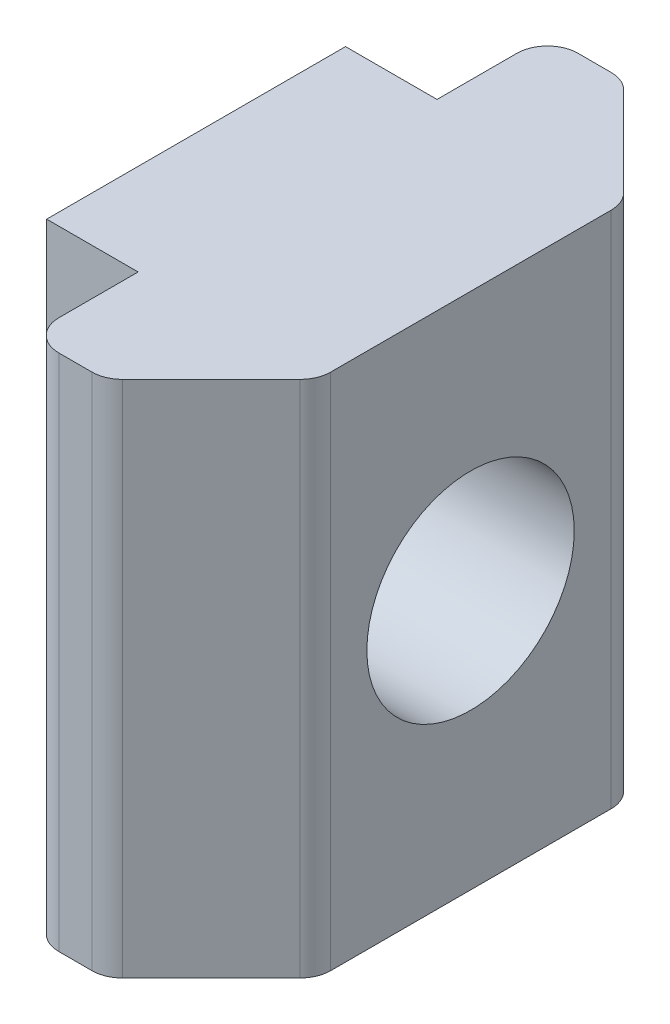
ISO-10303-21;
HEADER;
FILE_DESCRIPTION(('STEP AP214'),'2;1');
FILE_NAME('part.step','',(''),(''),'','','');
FILE_SCHEMA(('AUTOMOTIVE_DESIGN { 1 0 10303 214 1 1 1 1 }'));
ENDSEC;
DATA;
#1=APPLICATION_CONTEXT('core data for automotive mechanical design processes');
#2=APPLICATION_PROTOCOL_DEFINITION('international standard','automotive_design',2000,#1);
#3=PRODUCT_CONTEXT('',#1,'mechanical');
#4=PRODUCT('Part','Part','',(#3));
#5=PRODUCT_RELATED_PRODUCT_CATEGORY('part','',(#4));
#6=PRODUCT_DEFINITION_FORMATION('','',#4);
#7=PRODUCT_DEFINITION_CONTEXT('part definition',#1,'design');
#8=PRODUCT_DEFINITION('design','',#6,#7);
#9=PRODUCT_DEFINITION_SHAPE('','',#8);
#10=(LENGTH_UNIT() NAMED_UNIT(*) SI_UNIT(.MILLI.,.METRE.));
#11=(NAMED_UNIT(*) PLANE_ANGLE_UNIT() SI_UNIT($,.RADIAN.));
#12=(NAMED_UNIT(*) SI_UNIT($,.STERADIAN.) SOLID_ANGLE_UNIT());
#13=UNCERTAINTY_MEASURE_WITH_UNIT(LENGTH_MEASURE(1.E-05),#10,'distance_accuracy_value','');
#14=(GEOMETRIC_REPRESENTATION_CONTEXT(3) GLOBAL_UNCERTAINTY_ASSIGNED_CONTEXT((#13)) GLOBAL_UNIT_ASSIGNED_CONTEXT((#10,
#11,#12)) REPRESENTATION_CONTEXT('',''));
#15=CARTESIAN_POINT('',(0.,0.,0.));
#16=DIRECTION('',(0.,0.,1.));
#17=DIRECTION('',(1.,0.,0.));
#18=AXIS2_PLACEMENT_3D('',#15,#16,#17);
#19=CARTESIAN_POINT('',(8.42138897675098,17.,17.559438485096));
#20=DIRECTION('',(0.,-1.,0.));
#21=DIRECTION('',(0.,0.,-1.));
#22=AXIS2_PLACEMENT_3D('',#19,#20,#21);
#23=CYLINDRICAL_SURFACE('',#22,0.999999999999999);
#24=CARTESIAN_POINT('',(8.42138897675098,0.,17.559438485096));
#25=DIRECTION('',(0.,1.,0.));
#26=DIRECTION('',(0.,0.,1.));
#27=AXIS2_PLACEMENT_3D('',#24,#25,#26);
#28=CIRCLE('',#27,0.999999999999999);
#29=CARTESIAN_POINT('',(7.42138897675098,0.,17.5594385374559));
#30=VERTEX_POINT('',#29);
#31=CARTESIAN_POINT('',(8.42138915128389,0.,18.559438485096));
#32=VERTEX_POINT('',#31);
#33=EDGE_CURVE('E177',#30,#32,#28,.T.);
#34=ORIENTED_EDGE('',*,*,#33,.T.);
#35=DIRECTION('',(0.,-1.,0.));
#36=VECTOR('',#35,1.);
#37=CARTESIAN_POINT('',(8.42138915128389,17.,18.559438485096));
#38=LINE('',#37,#36);
#39=CARTESIAN_POINT('',(8.42138915128389,17.,18.559438485096));
#40=VERTEX_POINT('',#39);
#41=EDGE_CURVE('E11',#40,#32,#38,.T.);
#42=ORIENTED_EDGE('',*,*,#41,.F.);
#43=CARTESIAN_POINT('',(8.42138897675098,17.,17.559438485096));
#44=DIRECTION('',(0.,1.,0.));
#45=DIRECTION('',(0.,0.,1.));
#46=AXIS2_PLACEMENT_3D('',#43,#44,#45);
#47=CIRCLE('',#46,0.999999999999999);
#48=CARTESIAN_POINT('',(7.42138897675098,17.,17.5594385374559));
#49=VERTEX_POINT('',#48);
#50=EDGE_CURVE('E208',#49,#40,#47,.T.);
#51=ORIENTED_EDGE('',*,*,#50,.F.);
#52=DIRECTION('',(0.,-1.,0.));
#53=VECTOR('',#52,1.);
#54=CARTESIAN_POINT('',(7.42138897675098,17.,17.5594385374559));
#55=LINE('',#54,#53);
#56=EDGE_CURVE('E173',#49,#30,#55,.T.);
#57=ORIENTED_EDGE('',*,*,#56,.T.);
#58=EDGE_LOOP('',(#34,#42,#51,#57));
#59=FACE_BOUND('',#58,.T.);
#60=ADVANCED_FACE('F33',(#59),#23,.T.);
#61=CARTESIAN_POINT('',(9.50717615128388,17.,18.559438485096));
#62=DIRECTION('',(0.,0.,-1.));
#63=DIRECTION('',(-1.,0.,0.));
#64=AXIS2_PLACEMENT_3D('',#61,#62,#63);
#65=PLANE('',#64);
#66=DIRECTION('',(1.,0.,0.));
#67=VECTOR('',#66,1.);
#68=CARTESIAN_POINT('',(9.50717615128388,0.,18.559438485096));
#69=LINE('',#68,#67);
#70=CARTESIAN_POINT('',(9.50717615128388,0.,18.559438485096));
#71=VERTEX_POINT('',#70);
#72=EDGE_CURVE('E180',#32,#71,#69,.T.);
#73=ORIENTED_EDGE('',*,*,#72,.T.);
#74=DIRECTION('',(0.,-1.,0.));
#75=VECTOR('',#74,1.);
#76=CARTESIAN_POINT('',(9.50717615128388,17.,18.559438485096));
#77=LINE('',#76,#75);
#78=CARTESIAN_POINT('',(9.50717615128388,17.,18.559438485096));
#79=VERTEX_POINT('',#78);
#80=EDGE_CURVE('E41',#79,#71,#77,.T.);
#81=ORIENTED_EDGE('',*,*,#80,.F.);
#82=DIRECTION('',(1.,0.,0.));
#83=VECTOR('',#82,1.);
#84=CARTESIAN_POINT('',(9.50717615128388,17.,18.559438485096));
#85=LINE('',#84,#83);
#86=EDGE_CURVE('E116',#40,#79,#85,.T.);
#87=ORIENTED_EDGE('',*,*,#86,.F.);
#88=ORIENTED_EDGE('',*,*,#41,.T.);
#89=EDGE_LOOP('',(#73,#81,#87,#88));
#90=FACE_BOUND('',#89,.T.);
#91=ADVANCED_FACE('F306',(#90),#65,.F.);
#92=CARTESIAN_POINT('',(9.50717597675096,17.,17.559438485096));
#93=DIRECTION('',(0.,-1.,0.));
#94=DIRECTION('',(0.,0.,-1.));
#95=AXIS2_PLACEMENT_3D('',#92,#93,#94);
#96=CYLINDRICAL_SURFACE('',#95,0.999999999999999);
#97=CARTESIAN_POINT('',(9.50717597675096,0.,17.559438485096));
#98=DIRECTION('',(0.,1.,0.));
#99=DIRECTION('',(0.,0.,1.));
#100=AXIS2_PLACEMENT_3D('',#97,#98,#99);
#101=CIRCLE('',#100,0.999999999999999);
#102=CARTESIAN_POINT('',(10.2142827579375,0.,18.2665452662826));
#103=VERTEX_POINT('',#102);
#104=EDGE_CURVE('E183',#71,#103,#101,.T.);
#105=ORIENTED_EDGE('',*,*,#104,.T.);
#106=DIRECTION('',(0.,-1.,0.));
#107=VECTOR('',#106,1.);
#108=CARTESIAN_POINT('',(10.2142827579375,17.,18.2665452662826));
#109=LINE('',#108,#107);
#110=CARTESIAN_POINT('',(10.2142827579375,17.,18.2665452662826));
#111=VERTEX_POINT('',#110);
#112=EDGE_CURVE('E239',#111,#103,#109,.T.);
#113=ORIENTED_EDGE('',*,*,#112,.F.);
#114=CARTESIAN_POINT('',(9.50717597675096,17.,17.559438485096));
#115=DIRECTION('',(0.,1.,0.));
#116=DIRECTION('',(0.,0.,1.));
#117=AXIS2_PLACEMENT_3D('',#114,#115,#116);
#118=CIRCLE('',#117,0.999999999999999);
#119=EDGE_CURVE('E247',#79,#111,#118,.T.);
#120=ORIENTED_EDGE('',*,*,#119,.F.);
#121=ORIENTED_EDGE('',*,*,#80,.T.);
#122=EDGE_LOOP('',(#105,#113,#120,#121));
#123=FACE_BOUND('',#122,.T.);
#124=ADVANCED_FACE('F245',(#123),#96,.T.);
#125=CARTESIAN_POINT('',(10.2142827579375,17.,18.2665452662826));
#126=DIRECTION('',(-0.707106728093478,0.,-0.707106834279614));
#127=DIRECTION('',(-0.707106834279614,0.,0.707106728093478));
#128=AXIS2_PLACEMENT_3D('',#125,#126,#127);
#129=PLANE('',#128);
#130=DIRECTION('',(0.707106834279614,0.,-0.707106728093477));
#131=VECTOR('',#130,1.);
#132=CARTESIAN_POINT('',(10.2142827579375,0.,18.2665452662826));
#133=LINE('',#132,#131);
#134=CARTESIAN_POINT('',(13.1284959767511,0.,15.352332485096));
#135=VERTEX_POINT('',#134);
#136=EDGE_CURVE('E185',#103,#135,#133,.T.);
#137=ORIENTED_EDGE('',*,*,#136,.T.);
#138=DIRECTION('',(0.,-1.,0.));
#139=VECTOR('',#138,1.);
#140=CARTESIAN_POINT('',(13.1284959767511,17.,15.352332485096));
#141=LINE('',#140,#139);
#142=CARTESIAN_POINT('',(13.1284959767511,17.,15.352332485096));
#143=VERTEX_POINT('',#142);
#144=EDGE_CURVE('E236',#143,#135,#141,.T.);
#145=ORIENTED_EDGE('',*,*,#144,.F.);
#146=DIRECTION('',(0.707106834279614,0.,-0.707106728093477));
#147=VECTOR('',#146,1.);
#148=CARTESIAN_POINT('',(10.2142827579375,17.,18.2665452662826));
#149=LINE('',#148,#147);
#150=EDGE_CURVE('E265',#111,#143,#149,.T.);
#151=ORIENTED_EDGE('',*,*,#150,.F.);
#152=ORIENTED_EDGE('',*,*,#112,.T.);
#153=EDGE_LOOP('',(#137,#145,#151,#152));
#154=FACE_BOUND('',#153,.T.);
#155=ADVANCED_FACE('F256',(#154),#129,.F.);
#156=CARTESIAN_POINT('',(12.421388976752,17.,14.645225922722));
#157=DIRECTION('',(0.,-1.,0.));
#158=DIRECTION('',(0.,0.,-1.));
#159=AXIS2_PLACEMENT_3D('',#156,#157,#158);
#160=CYLINDRICAL_SURFACE('',#159,1.);
#161=CARTESIAN_POINT('',(12.421388976752,0.,14.645225922722));
#162=DIRECTION('',(0.,1.,0.));
#163=DIRECTION('',(0.,0.,1.));
#164=AXIS2_PLACEMENT_3D('',#161,#162,#163);
#165=CIRCLE('',#164,1.);
#166=CARTESIAN_POINT('',(13.421388976751,0.,14.645224485096));
#167=VERTEX_POINT('',#166);
#168=EDGE_CURVE('E187',#135,#167,#165,.T.);
#169=ORIENTED_EDGE('',*,*,#168,.T.);
#170=DIRECTION('',(0.,-1.,0.));
#171=VECTOR('',#170,1.);
#172=CARTESIAN_POINT('',(13.421388976751,17.,14.645224485096));
#173=LINE('',#172,#171);
#174=CARTESIAN_POINT('',(13.421388976751,17.,14.645224485096));
#175=VERTEX_POINT('',#174);
#176=EDGE_CURVE('E233',#175,#167,#173,.T.);
#177=ORIENTED_EDGE('',*,*,#176,.F.);
#178=CARTESIAN_POINT('',(12.421388976752,17.,14.645225922722));
#179=DIRECTION('',(0.,1.,0.));
#180=DIRECTION('',(0.,0.,1.));
#181=AXIS2_PLACEMENT_3D('',#178,#179,#180);
#182=CIRCLE('',#181,1.);
#183=EDGE_CURVE('E262',#143,#175,#182,.T.);
#184=ORIENTED_EDGE('',*,*,#183,.F.);
#185=ORIENTED_EDGE('',*,*,#144,.T.);
#186=EDGE_LOOP('',(#169,#177,#184,#185));
#187=FACE_BOUND('',#186,.T.);
#188=ADVANCED_FACE('F260',(#187),#160,.T.);
#189=CARTESIAN_POINT('',(13.421388976751,17.,14.645224485096));
#190=DIRECTION('',(-1.,0.,0.));
#191=DIRECTION('',(0.,0.,1.));
#192=AXIS2_PLACEMENT_3D('',#189,#190,#191);
#193=PLANE('',#192);
#194=CARTESIAN_POINT('',(13.421388976751,8.5,10.059438485096));
#195=DIRECTION('',(-1.,0.,0.));
#196=DIRECTION('',(0.,0.,1.));
#197=AXIS2_PLACEMENT_3D('',#194,#195,#196);
#198=CIRCLE('',#197,3.4);
#199=CARTESIAN_POINT('',(13.421388976751,8.5,13.459438485096));
#200=VERTEX_POINT('',#199);
#201=EDGE_CURVE('E181',#200,#200,#198,.T.);
#202=ORIENTED_EDGE('',*,*,#201,.T.);
#203=EDGE_LOOP('',(#202));
#204=FACE_BOUND('',#203,.T.);
#205=DIRECTION('',(0.,0.,-1.));
#206=VECTOR('',#205,1.);
#207=CARTESIAN_POINT('',(13.421388976751,0.,14.645224485096));
#208=LINE('',#207,#206);
#209=CARTESIAN_POINT('',(13.421388976751,0.,5.45164148509603));
#210=VERTEX_POINT('',#209);
#211=EDGE_CURVE('E189',#167,#210,#208,.T.);
#212=ORIENTED_EDGE('',*,*,#211,.T.);
#213=DIRECTION('',(0.,-1.,0.));
#214=VECTOR('',#213,1.);
#215=CARTESIAN_POINT('',(13.421388976751,17.,5.45164148509603));
#216=LINE('',#215,#214);
#217=CARTESIAN_POINT('',(13.421388976751,17.,5.45164148509603));
#218=VERTEX_POINT('',#217);
#219=EDGE_CURVE('E230',#218,#210,#216,.T.);
#220=ORIENTED_EDGE('',*,*,#219,.F.);
#221=DIRECTION('',(0.,0.,-1.));
#222=VECTOR('',#221,1.);
#223=CARTESIAN_POINT('',(13.421388976751,17.,14.645224485096));
#224=LINE('',#223,#222);
#225=EDGE_CURVE('E264',#175,#218,#224,.T.);
#226=ORIENTED_EDGE('',*,*,#225,.F.);
#227=ORIENTED_EDGE('',*,*,#176,.T.);
#228=EDGE_LOOP('',(#212,#220,#226,#227));
#229=FACE_BOUND('',#228,.T.);
#230=ADVANCED_FACE('F319',(#204,#229),#193,.F.);
#231=CARTESIAN_POINT('',(12.4213889767511,17.,5.45164204746913));
#232=DIRECTION('',(0.,-1.,0.));
#233=DIRECTION('',(0.,0.,-1.));
#234=AXIS2_PLACEMENT_3D('',#231,#232,#233);
#235=CYLINDRICAL_SURFACE('',#234,1.);
#236=CARTESIAN_POINT('',(12.4213889767511,0.,5.45164204746913));
#237=DIRECTION('',(0.,1.,0.));
#238=DIRECTION('',(0.,0.,1.));
#239=AXIS2_PLACEMENT_3D('',#236,#237,#238);
#240=CIRCLE('',#239,1.);
#241=CARTESIAN_POINT('',(13.1284959767511,0.,4.74453548509602));
#242=VERTEX_POINT('',#241);
#243=EDGE_CURVE('E191',#210,#242,#240,.T.);
#244=ORIENTED_EDGE('',*,*,#243,.T.);
#245=DIRECTION('',(0.,-1.,0.));
#246=VECTOR('',#245,1.);
#247=CARTESIAN_POINT('',(13.1284959767511,17.,4.74453548509602));
#248=LINE('',#247,#246);
#249=CARTESIAN_POINT('',(13.1284959767511,17.,4.74453548509602));
#250=VERTEX_POINT('',#249);
#251=EDGE_CURVE('E227',#250,#242,#248,.T.);
#252=ORIENTED_EDGE('',*,*,#251,.F.);
#253=CARTESIAN_POINT('',(12.4213889767511,17.,5.45164204746913));
#254=DIRECTION('',(0.,1.,0.));
#255=DIRECTION('',(0.,0.,1.));
#256=AXIS2_PLACEMENT_3D('',#253,#254,#255);
#257=CIRCLE('',#256,1.);
#258=EDGE_CURVE('E267',#218,#250,#257,.T.);
#259=ORIENTED_EDGE('',*,*,#258,.F.);
#260=ORIENTED_EDGE('',*,*,#219,.T.);
#261=EDGE_LOOP('',(#244,#252,#259,#260));
#262=FACE_BOUND('',#261,.T.);
#263=ADVANCED_FACE('F322',(#262),#235,.T.);
#264=CARTESIAN_POINT('',(10.2142827579375,17.,1.83032070390948));
#265=DIRECTION('',(-0.707106970734121,0.,0.707106591638924));
#266=DIRECTION('',(0.707106591638924,0.,0.707106970734121));
#267=AXIS2_PLACEMENT_3D('',#264,#265,#266);
#268=PLANE('',#267);
#269=DIRECTION('',(-0.707106591638924,0.,-0.707106970734121));
#270=VECTOR('',#269,1.);
#271=CARTESIAN_POINT('',(10.2142827579375,0.,1.83032070390948));
#272=LINE('',#271,#270);
#273=CARTESIAN_POINT('',(10.2142827579375,0.,1.83032070390948));
#274=VERTEX_POINT('',#273);
#275=EDGE_CURVE('E193',#242,#274,#272,.T.);
#276=ORIENTED_EDGE('',*,*,#275,.T.);
#277=DIRECTION('',(0.,-1.,0.));
#278=VECTOR('',#277,1.);
#279=CARTESIAN_POINT('',(10.2142827579375,17.,1.83032070390948));
#280=LINE('',#279,#278);
#281=CARTESIAN_POINT('',(10.2142827579375,17.,1.83032070390948));
#282=VERTEX_POINT('',#281);
#283=EDGE_CURVE('E224',#282,#274,#280,.T.);
#284=ORIENTED_EDGE('',*,*,#283,.F.);
#285=DIRECTION('',(-0.707106591638924,0.,-0.707106970734121));
#286=VECTOR('',#285,1.);
#287=CARTESIAN_POINT('',(10.2142827579375,17.,1.83032070390948));
#288=LINE('',#287,#286);
#289=EDGE_CURVE('E273',#250,#282,#288,.T.);
#290=ORIENTED_EDGE('',*,*,#289,.F.);
#291=ORIENTED_EDGE('',*,*,#251,.T.);
#292=EDGE_LOOP('',(#276,#284,#290,#291));
#293=FACE_BOUND('',#292,.T.);
#294=ADVANCED_FACE('F326',(#293),#268,.F.);
#295=CARTESIAN_POINT('',(9.50717597675096,17.,2.53742748509603));
#296=DIRECTION('',(0.,-1.,0.));
#297=DIRECTION('',(0.,0.,-1.));
#298=AXIS2_PLACEMENT_3D('',#295,#296,#297);
#299=CYLINDRICAL_SURFACE('',#298,1.);
#300=CARTESIAN_POINT('',(9.50717597675096,0.,2.53742748509603));
#301=DIRECTION('',(0.,1.,0.));
#302=DIRECTION('',(0.,0.,1.));
#303=AXIS2_PLACEMENT_3D('',#300,#301,#302);
#304=CIRCLE('',#303,1.);
#305=CARTESIAN_POINT('',(9.50717597675096,0.,1.53742748509603));
#306=VERTEX_POINT('',#305);
#307=EDGE_CURVE('E195',#274,#306,#304,.T.);
#308=ORIENTED_EDGE('',*,*,#307,.T.);
#309=DIRECTION('',(0.,-1.,0.));
#310=VECTOR('',#309,1.);
#311=CARTESIAN_POINT('',(9.50717597675096,17.,1.53742748509603));
#312=LINE('',#311,#310);
#313=CARTESIAN_POINT('',(9.50717597675096,17.,1.53742748509603));
#314=VERTEX_POINT('',#313);
#315=EDGE_CURVE('E221',#314,#306,#312,.T.);
#316=ORIENTED_EDGE('',*,*,#315,.F.);
#317=CARTESIAN_POINT('',(9.50717597675096,17.,2.53742748509603));
#318=DIRECTION('',(0.,1.,0.));
#319=DIRECTION('',(0.,0.,1.));
#320=AXIS2_PLACEMENT_3D('',#317,#318,#319);
#321=CIRCLE('',#320,1.);
#322=EDGE_CURVE('E275',#282,#314,#321,.T.);
#323=ORIENTED_EDGE('',*,*,#322,.F.);
#324=ORIENTED_EDGE('',*,*,#283,.T.);
#325=EDGE_LOOP('',(#308,#316,#323,#324));
#326=FACE_BOUND('',#325,.T.);
#327=ADVANCED_FACE('F330',(#326),#299,.T.);
#328=CARTESIAN_POINT('',(9.50717597675096,17.,1.53742748509603));
#329=DIRECTION('',(0.,0.,1.));
#330=DIRECTION('',(1.,0.,0.));
#331=AXIS2_PLACEMENT_3D('',#328,#329,#330);
#332=PLANE('',#331);
#333=DIRECTION('',(-1.,0.,0.));
#334=VECTOR('',#333,1.);
#335=CARTESIAN_POINT('',(9.50717597675096,0.,1.53742748509603));
#336=LINE('',#335,#334);
#337=CARTESIAN_POINT('',(8.42138897675098,0.,1.53742748509603));
#338=VERTEX_POINT('',#337);
#339=EDGE_CURVE('E197',#306,#338,#336,.T.);
#340=ORIENTED_EDGE('',*,*,#339,.T.);
#341=DIRECTION('',(0.,-1.,0.));
#342=VECTOR('',#341,1.);
#343=CARTESIAN_POINT('',(8.42138897675098,17.,1.53742748509603));
#344=LINE('',#343,#342);
#345=CARTESIAN_POINT('',(8.42138897675098,17.,1.53742748509603));
#346=VERTEX_POINT('',#345);
#347=EDGE_CURVE('E218',#346,#338,#344,.T.);
#348=ORIENTED_EDGE('',*,*,#347,.F.);
#349=DIRECTION('',(-1.,0.,0.));
#350=VECTOR('',#349,1.);
#351=CARTESIAN_POINT('',(9.50717597675096,17.,1.53742748509603));
#352=LINE('',#351,#350);
#353=EDGE_CURVE('E277',#314,#346,#352,.T.);
#354=ORIENTED_EDGE('',*,*,#353,.F.);
#355=ORIENTED_EDGE('',*,*,#315,.T.);
#356=EDGE_LOOP('',(#340,#348,#354,#355));
#357=FACE_BOUND('',#356,.T.);
#358=ADVANCED_FACE('F334',(#357),#332,.F.);
#359=CARTESIAN_POINT('',(8.42138897675098,17.,2.53742748509603));
#360=DIRECTION('',(0.,-1.,0.));
#361=DIRECTION('',(0.,0.,-1.));
#362=AXIS2_PLACEMENT_3D('',#359,#360,#361);
#363=CYLINDRICAL_SURFACE('',#362,1.);
#364=CARTESIAN_POINT('',(8.42138897675098,0.,2.53742748509603));
#365=DIRECTION('',(0.,1.,0.));
#366=DIRECTION('',(0.,0.,1.));
#367=AXIS2_PLACEMENT_3D('',#364,#365,#366);
#368=CIRCLE('',#367,1.);
#369=CARTESIAN_POINT('',(7.42138897675098,0.,2.53742753745591));
#370=VERTEX_POINT('',#369);
#371=EDGE_CURVE('E199',#338,#370,#368,.T.);
#372=ORIENTED_EDGE('',*,*,#371,.T.);
#373=DIRECTION('',(0.,-1.,0.));
#374=VECTOR('',#373,1.);
#375=CARTESIAN_POINT('',(7.42138897675098,17.,2.53742753745591));
#376=LINE('',#375,#374);
#377=CARTESIAN_POINT('',(7.42138897675098,17.,2.53742753745591));
#378=VERTEX_POINT('',#377);
#379=EDGE_CURVE('E215',#378,#370,#376,.T.);
#380=ORIENTED_EDGE('',*,*,#379,.F.);
#381=CARTESIAN_POINT('',(8.42138897675098,17.,2.53742748509603));
#382=DIRECTION('',(0.,1.,0.));
#383=DIRECTION('',(0.,0.,1.));
#384=AXIS2_PLACEMENT_3D('',#381,#382,#383);
#385=CIRCLE('',#384,1.);
#386=EDGE_CURVE('E279',#346,#378,#385,.T.);
#387=ORIENTED_EDGE('',*,*,#386,.F.);
#388=ORIENTED_EDGE('',*,*,#347,.T.);
#389=EDGE_LOOP('',(#372,#380,#387,#388));
#390=FACE_BOUND('',#389,.T.);
#391=ADVANCED_FACE('F338',(#390),#363,.T.);
#392=CARTESIAN_POINT('',(7.42138897675098,17.,5.15943848509603));
#393=DIRECTION('',(1.,0.,0.));
#394=DIRECTION('',(0.,0.,-1.));
#395=AXIS2_PLACEMENT_3D('',#392,#393,#394);
#396=PLANE('',#395);
#397=DIRECTION('',(0.,0.,1.));
#398=VECTOR('',#397,1.);
#399=CARTESIAN_POINT('',(7.42138897675098,0.,5.15943848509603));
#400=LINE('',#399,#398);
#401=CARTESIAN_POINT('',(7.42138897675098,0.,5.15943848509603));
#402=VERTEX_POINT('',#401);
#403=EDGE_CURVE('E201',#370,#402,#400,.T.);
#404=ORIENTED_EDGE('',*,*,#403,.T.);
#405=DIRECTION('',(0.,-1.,0.));
#406=VECTOR('',#405,1.);
#407=CARTESIAN_POINT('',(7.42138897675098,17.,5.15943848509603));
#408=LINE('',#407,#406);
#409=CARTESIAN_POINT('',(7.42138897675098,17.,5.15943848509603));
#410=VERTEX_POINT('',#409);
#411=EDGE_CURVE('E212',#410,#402,#408,.T.);
#412=ORIENTED_EDGE('',*,*,#411,.F.);
#413=DIRECTION('',(0.,0.,1.));
#414=VECTOR('',#413,1.);
#415=CARTESIAN_POINT('',(7.42138897675098,17.,5.15943848509603));
#416=LINE('',#415,#414);
#417=EDGE_CURVE('E281',#378,#410,#416,.T.);
#418=ORIENTED_EDGE('',*,*,#417,.F.);
#419=ORIENTED_EDGE('',*,*,#379,.T.);
#420=EDGE_LOOP('',(#404,#412,#418,#419));
#421=FACE_BOUND('',#420,.T.);
#422=ADVANCED_FACE('F287',(#421),#396,.F.);
#423=CARTESIAN_POINT('',(7.42138897675098,17.,5.15943848509603));
#424=DIRECTION('',(0.,0.,1.));
#425=DIRECTION('',(1.,0.,0.));
#426=AXIS2_PLACEMENT_3D('',#423,#424,#425);
#427=PLANE('',#426);
#428=DIRECTION('',(-1.,0.,0.));
#429=VECTOR('',#428,1.);
#430=CARTESIAN_POINT('',(7.42138897675098,0.,5.15943848509603));
#431=LINE('',#430,#429);
#432=CARTESIAN_POINT('',(4.421388976751,0.,5.15943848509603));
#433=VERTEX_POINT('',#432);
#434=EDGE_CURVE('E203',#402,#433,#431,.T.);
#435=ORIENTED_EDGE('',*,*,#434,.T.);
#436=DIRECTION('',(0.,-1.,0.));
#437=VECTOR('',#436,1.);
#438=CARTESIAN_POINT('',(4.421388976751,17.,5.15943848509603));
#439=LINE('',#438,#437);
#440=CARTESIAN_POINT('',(4.421388976751,17.,5.15943848509603));
#441=VERTEX_POINT('',#440);
#442=EDGE_CURVE('E168',#441,#433,#439,.T.);
#443=ORIENTED_EDGE('',*,*,#442,.F.);
#444=DIRECTION('',(-1.,0.,0.));
#445=VECTOR('',#444,1.);
#446=CARTESIAN_POINT('',(7.42138897675098,17.,5.15943848509603));
#447=LINE('',#446,#445);
#448=EDGE_CURVE('E159',#410,#441,#447,.T.);
#449=ORIENTED_EDGE('',*,*,#448,.F.);
#450=ORIENTED_EDGE('',*,*,#411,.T.);
#451=EDGE_LOOP('',(#435,#443,#449,#450));
#452=FACE_BOUND('',#451,.T.);
#453=ADVANCED_FACE('F291',(#452),#427,.F.);
#454=CARTESIAN_POINT('',(4.421388976751,17.,14.959438485096));
#455=DIRECTION('',(1.,0.,0.));
#456=DIRECTION('',(0.,0.,-1.));
#457=AXIS2_PLACEMENT_3D('',#454,#455,#456);
#458=PLANE('',#457);
#459=CARTESIAN_POINT('',(4.421388976751,8.5,10.059438485096));
#460=DIRECTION('',(-1.,0.,0.));
#461=DIRECTION('',(0.,0.,1.));
#462=AXIS2_PLACEMENT_3D('',#459,#460,#461);
#463=CIRCLE('',#462,3.4);
#464=CARTESIAN_POINT('',(4.421388976751,8.5,13.459438485096));
#465=VERTEX_POINT('',#464);
#466=EDGE_CURVE('E353',#465,#465,#463,.T.);
#467=ORIENTED_EDGE('',*,*,#466,.F.);
#468=EDGE_LOOP('',(#467));
#469=FACE_BOUND('',#468,.T.);
#470=DIRECTION('',(0.,0.,1.));
#471=VECTOR('',#470,1.);
#472=CARTESIAN_POINT('',(4.421388976751,0.,14.959438485096));
#473=LINE('',#472,#471);
#474=CARTESIAN_POINT('',(4.421388976751,0.,14.959438485096));
#475=VERTEX_POINT('',#474);
#476=EDGE_CURVE('E167',#433,#475,#473,.T.);
#477=ORIENTED_EDGE('',*,*,#476,.T.);
#478=DIRECTION('',(0.,-1.,0.));
#479=VECTOR('',#478,1.);
#480=CARTESIAN_POINT('',(4.421388976751,17.,14.959438485096));
#481=LINE('',#480,#479);
#482=CARTESIAN_POINT('',(4.421388976751,17.,14.959438485096));
#483=VERTEX_POINT('',#482);
#484=EDGE_CURVE('E164',#483,#475,#481,.T.);
#485=ORIENTED_EDGE('',*,*,#484,.F.);
#486=DIRECTION('',(0.,0.,1.));
#487=VECTOR('',#486,1.);
#488=CARTESIAN_POINT('',(4.421388976751,17.,14.959438485096));
#489=LINE('',#488,#487);
#490=EDGE_CURVE('E153',#441,#483,#489,.T.);
#491=ORIENTED_EDGE('',*,*,#490,.F.);
#492=ORIENTED_EDGE('',*,*,#442,.T.);
#493=EDGE_LOOP('',(#477,#485,#491,#492));
#494=FACE_BOUND('',#493,.T.);
#495=ADVANCED_FACE('F165',(#469,#494),#458,.F.);
#496=CARTESIAN_POINT('',(7.42138897675098,17.,14.959438485096));
#497=DIRECTION('',(0.,0.,-1.));
#498=DIRECTION('',(-1.,0.,0.));
#499=AXIS2_PLACEMENT_3D('',#496,#497,#498);
#500=PLANE('',#499);
#501=DIRECTION('',(1.,0.,0.));
#502=VECTOR('',#501,1.);
#503=CARTESIAN_POINT('',(7.42138897675098,0.,14.959438485096));
#504=LINE('',#503,#502);
#505=CARTESIAN_POINT('',(7.42138897675098,0.,14.959438485096));
#506=VERTEX_POINT('',#505);
#507=EDGE_CURVE('E102',#475,#506,#504,.T.);
#508=ORIENTED_EDGE('',*,*,#507,.T.);
#509=DIRECTION('',(0.,-1.,0.));
#510=VECTOR('',#509,1.);
#511=CARTESIAN_POINT('',(7.42138897675098,17.,14.959438485096));
#512=LINE('',#511,#510);
#513=CARTESIAN_POINT('',(7.42138897675098,17.,14.959438485096));
#514=VERTEX_POINT('',#513);
#515=EDGE_CURVE('E169',#514,#506,#512,.T.);
#516=ORIENTED_EDGE('',*,*,#515,.F.);
#517=DIRECTION('',(1.,0.,0.));
#518=VECTOR('',#517,1.);
#519=CARTESIAN_POINT('',(7.42138897675098,17.,14.959438485096));
#520=LINE('',#519,#518);
#521=EDGE_CURVE('E157',#483,#514,#520,.T.);
#522=ORIENTED_EDGE('',*,*,#521,.F.);
#523=ORIENTED_EDGE('',*,*,#484,.T.);
#524=EDGE_LOOP('',(#508,#516,#522,#523));
#525=FACE_BOUND('',#524,.T.);
#526=ADVANCED_FACE('F171',(#525),#500,.F.);
#527=CARTESIAN_POINT('',(7.42138897675098,17.,17.5594385374559));
#528=DIRECTION('',(1.,0.,0.));
#529=DIRECTION('',(0.,0.,-1.));
#530=AXIS2_PLACEMENT_3D('',#527,#528,#529);
#531=PLANE('',#530);
#532=DIRECTION('',(0.,0.,1.));
#533=VECTOR('',#532,1.);
#534=CARTESIAN_POINT('',(7.42138897675098,0.,17.5594385374559));
#535=LINE('',#534,#533);
#536=EDGE_CURVE('E108',#506,#30,#535,.T.);
#537=ORIENTED_EDGE('',*,*,#536,.T.);
#538=ORIENTED_EDGE('',*,*,#56,.F.);
#539=DIRECTION('',(0.,0.,1.));
#540=VECTOR('',#539,1.);
#541=CARTESIAN_POINT('',(7.42138897675098,17.,17.5594385374559));
#542=LINE('',#541,#540);
#543=EDGE_CURVE('E49',#514,#49,#542,.T.);
#544=ORIENTED_EDGE('',*,*,#543,.F.);
#545=ORIENTED_EDGE('',*,*,#515,.T.);
#546=EDGE_LOOP('',(#537,#538,#544,#545));
#547=FACE_BOUND('',#546,.T.);
#548=ADVANCED_FACE('F295',(#547),#531,.F.);
#549=CARTESIAN_POINT('',(8.42138897675098,17.,17.559438485096));
#550=DIRECTION('',(0.,1.,0.));
#551=DIRECTION('',(0.,0.,1.));
#552=AXIS2_PLACEMENT_3D('',#549,#550,#551);
#553=PLANE('',#552);
#554=ORIENTED_EDGE('',*,*,#50,.T.);
#555=ORIENTED_EDGE('',*,*,#86,.T.);
#556=ORIENTED_EDGE('',*,*,#119,.T.);
#557=ORIENTED_EDGE('',*,*,#150,.T.);
#558=ORIENTED_EDGE('',*,*,#183,.T.);
#559=ORIENTED_EDGE('',*,*,#225,.T.);
#560=ORIENTED_EDGE('',*,*,#258,.T.);
#561=ORIENTED_EDGE('',*,*,#289,.T.);
#562=ORIENTED_EDGE('',*,*,#322,.T.);
#563=ORIENTED_EDGE('',*,*,#353,.T.);
#564=ORIENTED_EDGE('',*,*,#386,.T.);
#565=ORIENTED_EDGE('',*,*,#417,.T.);
#566=ORIENTED_EDGE('',*,*,#448,.T.);
#567=ORIENTED_EDGE('',*,*,#490,.T.);
#568=ORIENTED_EDGE('',*,*,#521,.T.);
#569=ORIENTED_EDGE('',*,*,#543,.T.);
#570=EDGE_LOOP('',(#554,#555,#556,#557,#558,#559,#560,#561,#562,#563,#564,#565,#566,#567,#568,#569));
#571=FACE_BOUND('',#570,.T.);
#572=ADVANCED_FACE('F155',(#571),#553,.T.);
#573=CARTESIAN_POINT('',(8.42138897675098,0.,17.559438485096));
#574=DIRECTION('',(0.,1.,0.));
#575=DIRECTION('',(0.,0.,1.));
#576=AXIS2_PLACEMENT_3D('',#573,#574,#575);
#577=PLANE('',#576);
#578=ORIENTED_EDGE('',*,*,#33,.F.);
#579=ORIENTED_EDGE('',*,*,#536,.F.);
#580=ORIENTED_EDGE('',*,*,#507,.F.);
#581=ORIENTED_EDGE('',*,*,#476,.F.);
#582=ORIENTED_EDGE('',*,*,#434,.F.);
#583=ORIENTED_EDGE('',*,*,#403,.F.);
#584=ORIENTED_EDGE('',*,*,#371,.F.);
#585=ORIENTED_EDGE('',*,*,#339,.F.);
#586=ORIENTED_EDGE('',*,*,#307,.F.);
#587=ORIENTED_EDGE('',*,*,#275,.F.);
#588=ORIENTED_EDGE('',*,*,#243,.F.);
#589=ORIENTED_EDGE('',*,*,#211,.F.);
#590=ORIENTED_EDGE('',*,*,#168,.F.);
#591=ORIENTED_EDGE('',*,*,#136,.F.);
#592=ORIENTED_EDGE('',*,*,#104,.F.);
#593=ORIENTED_EDGE('',*,*,#72,.F.);
#594=EDGE_LOOP('',(#578,#579,#580,#581,#582,#583,#584,#585,#586,#587,#588,#589,#590,#591,#592,#593));
#595=FACE_BOUND('',#594,.T.);
#596=ADVANCED_FACE('F251',(#595),#577,.F.);
#597=CARTESIAN_POINT('',(4.421388976751,8.5,10.059438485096));
#598=DIRECTION('',(-1.,0.,0.));
#599=DIRECTION('',(0.,0.,1.));
#600=AXIS2_PLACEMENT_3D('',#597,#598,#599);
#601=CYLINDRICAL_SURFACE('',#600,3.4);
#602=ORIENTED_EDGE('',*,*,#201,.F.);
#603=EDGE_LOOP('',(#602));
#604=FACE_BOUND('',#603,.T.);
#605=ORIENTED_EDGE('',*,*,#466,.T.);
#606=EDGE_LOOP('',(#605));
#607=FACE_BOUND('',#606,.T.);
#608=ADVANCED_FACE('F363',(#604,#607),#601,.F.);
#609=CLOSED_SHELL('',(#60,#91,#124,#155,#188,#230,#263,#294,#327,#358,#391,#422,#453,#495,#526,
#548,#572,#596,#608));
#610=MANIFOLD_SOLID_BREP('B2',#609);
#611=ADVANCED_BREP_SHAPE_REPRESENTATION('',(#18,#610),#14);
#612=SHAPE_DEFINITION_REPRESENTATION(#9,#611);
ENDSEC;
END-ISO-10303-21;
